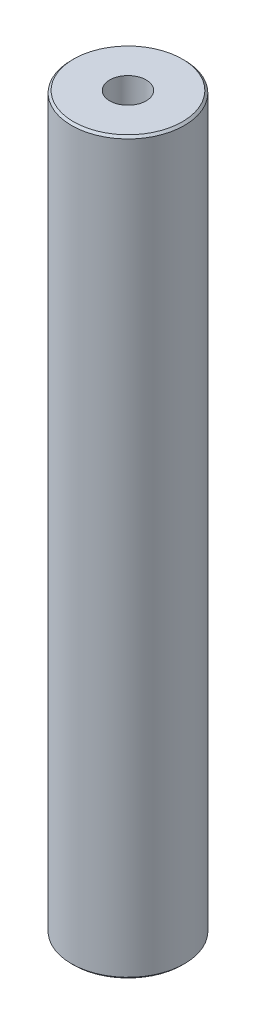
ISO-10303-21;
HEADER;
FILE_DESCRIPTION(('STEP AP214'),'2;1');
FILE_NAME('part.step','',(''),(''),'','','');
FILE_SCHEMA(('AUTOMOTIVE_DESIGN { 1 0 10303 214 1 1 1 1 }'));
ENDSEC;
DATA;
#1=APPLICATION_CONTEXT('core data for automotive mechanical design processes');
#2=APPLICATION_PROTOCOL_DEFINITION('international standard','automotive_design',2000,#1);
#3=PRODUCT_CONTEXT('',#1,'mechanical');
#4=PRODUCT('Part','Part','',(#3));
#5=PRODUCT_RELATED_PRODUCT_CATEGORY('part','',(#4));
#6=PRODUCT_DEFINITION_FORMATION('','',#4);
#7=PRODUCT_DEFINITION_CONTEXT('part definition',#1,'design');
#8=PRODUCT_DEFINITION('design','',#6,#7);
#9=PRODUCT_DEFINITION_SHAPE('','',#8);
#10=(LENGTH_UNIT() NAMED_UNIT(*) SI_UNIT(.MILLI.,.METRE.));
#11=(NAMED_UNIT(*) PLANE_ANGLE_UNIT() SI_UNIT($,.RADIAN.));
#12=(NAMED_UNIT(*) SI_UNIT($,.STERADIAN.) SOLID_ANGLE_UNIT());
#13=UNCERTAINTY_MEASURE_WITH_UNIT(LENGTH_MEASURE(1.E-05),#10,'distance_accuracy_value','');
#14=(GEOMETRIC_REPRESENTATION_CONTEXT(3) GLOBAL_UNCERTAINTY_ASSIGNED_CONTEXT((#13)) GLOBAL_UNIT_ASSIGNED_CONTEXT((#10,
#11,#12)) REPRESENTATION_CONTEXT('',''));
#15=CARTESIAN_POINT('',(0.,0.,0.));
#16=DIRECTION('',(0.,0.,1.));
#17=DIRECTION('',(1.,0.,0.));
#18=AXIS2_PLACEMENT_3D('',#15,#16,#17);
#19=CARTESIAN_POINT('',(0.,484.642296781617,0.));
#20=DIRECTION('',(0.,-1.,0.));
#21=DIRECTION('',(0.,0.,-1.));
#22=AXIS2_PLACEMENT_3D('',#19,#20,#21);
#23=CYLINDRICAL_SURFACE('',#22,37.5);
#24=CARTESIAN_POINT('',(0.,483.232724346313,0.));
#25=DIRECTION('',(0.,1.,0.));
#26=DIRECTION('',(0.,0.,1.));
#27=AXIS2_PLACEMENT_3D('',#24,#25,#26);
#28=CIRCLE('',#27,37.5);
#29=CARTESIAN_POINT('',(0.,483.232724346313,37.5));
#30=VERTEX_POINT('',#29);
#31=EDGE_CURVE('E50',#30,#30,#28,.F.);
#32=ORIENTED_EDGE('',*,*,#31,.T.);
#33=EDGE_LOOP('',(#32));
#34=FACE_BOUND('',#33,.T.);
#35=CARTESIAN_POINT('',(0.,1.4095724353041,0.));
#36=DIRECTION('',(0.,1.,0.));
#37=DIRECTION('',(0.,0.,1.));
#38=AXIS2_PLACEMENT_3D('',#35,#36,#37);
#39=CIRCLE('',#38,37.5);
#40=CARTESIAN_POINT('',(0.,1.4095724353041,37.5));
#41=VERTEX_POINT('',#40);
#42=EDGE_CURVE('E51',#41,#41,#39,.T.);
#43=ORIENTED_EDGE('',*,*,#42,.T.);
#44=EDGE_LOOP('',(#43));
#45=FACE_BOUND('',#44,.T.);
#46=ADVANCED_FACE('F39',(#34,#45),#23,.T.);
#47=CARTESIAN_POINT('',(0.,484.642296781617,0.));
#48=DIRECTION('',(0.,1.,0.));
#49=DIRECTION('',(0.,0.,1.));
#50=AXIS2_PLACEMENT_3D('',#47,#48,#49);
#51=PLANE('',#50);
#52=CARTESIAN_POINT('',(0.,484.642296781617,0.));
#53=DIRECTION('',(0.,1.,0.));
#54=DIRECTION('',(0.,0.,1.));
#55=AXIS2_PLACEMENT_3D('',#52,#53,#54);
#56=CIRCLE('',#55,36.090427564696);
#57=CARTESIAN_POINT('',(0.,484.642296781617,36.090427564696));
#58=VERTEX_POINT('',#57);
#59=EDGE_CURVE('E54',#58,#58,#56,.T.);
#60=ORIENTED_EDGE('',*,*,#59,.T.);
#61=EDGE_LOOP('',(#60));
#62=FACE_BOUND('',#61,.T.);
#63=CARTESIAN_POINT('',(0.,484.642296781617,0.));
#64=DIRECTION('',(0.,1.,0.));
#65=DIRECTION('',(0.,0.,1.));
#66=AXIS2_PLACEMENT_3D('',#63,#64,#65);
#67=CIRCLE('',#66,12.0826649952808);
#68=CARTESIAN_POINT('',(0.,484.642296781617,12.0826649952808));
#69=VERTEX_POINT('',#68);
#70=EDGE_CURVE('E58',#69,#69,#67,.T.);
#71=ORIENTED_EDGE('',*,*,#70,.F.);
#72=EDGE_LOOP('',(#71));
#73=FACE_BOUND('',#72,.T.);
#74=ADVANCED_FACE('F69',(#62,#73),#51,.T.);
#75=CARTESIAN_POINT('',(0.,0.,0.));
#76=DIRECTION('',(0.,1.,0.));
#77=DIRECTION('',(0.,0.,1.));
#78=AXIS2_PLACEMENT_3D('',#75,#76,#77);
#79=PLANE('',#78);
#80=CARTESIAN_POINT('',(0.,0.,0.));
#81=DIRECTION('',(0.,1.,0.));
#82=DIRECTION('',(0.,0.,1.));
#83=AXIS2_PLACEMENT_3D('',#80,#81,#82);
#84=CIRCLE('',#83,36.0904275646959);
#85=CARTESIAN_POINT('',(0.,0.,36.0904275646959));
#86=VERTEX_POINT('',#85);
#87=EDGE_CURVE('E10',#86,#86,#84,.F.);
#88=ORIENTED_EDGE('',*,*,#87,.T.);
#89=EDGE_LOOP('',(#88));
#90=FACE_BOUND('',#89,.T.);
#91=CARTESIAN_POINT('',(0.,0.,0.));
#92=DIRECTION('',(0.,1.,0.));
#93=DIRECTION('',(0.,0.,1.));
#94=AXIS2_PLACEMENT_3D('',#91,#92,#93);
#95=CIRCLE('',#94,12.0826649952808);
#96=CARTESIAN_POINT('',(0.,0.,12.0826649952808));
#97=VERTEX_POINT('',#96);
#98=EDGE_CURVE('E63',#97,#97,#95,.T.);
#99=ORIENTED_EDGE('',*,*,#98,.T.);
#100=EDGE_LOOP('',(#99));
#101=FACE_BOUND('',#100,.T.);
#102=ADVANCED_FACE('F75',(#90,#101),#79,.F.);
#103=CARTESIAN_POINT('',(0.,484.642296781617,0.));
#104=DIRECTION('',(0.,-1.,0.));
#105=DIRECTION('',(0.,0.,-1.));
#106=AXIS2_PLACEMENT_3D('',#103,#104,#105);
#107=CYLINDRICAL_SURFACE('',#106,12.0826649952808);
#108=ORIENTED_EDGE('',*,*,#70,.T.);
#109=EDGE_LOOP('',(#108));
#110=FACE_BOUND('',#109,.T.);
#111=ORIENTED_EDGE('',*,*,#98,.F.);
#112=EDGE_LOOP('',(#111));
#113=FACE_BOUND('',#112,.T.);
#114=ADVANCED_FACE('F70',(#110,#113),#107,.F.);
#115=CARTESIAN_POINT('',(0.,484.642296781617,0.));
#116=DIRECTION('',(0.,-1.,0.));
#117=DIRECTION('',(0.,0.,-1.));
#118=AXIS2_PLACEMENT_3D('',#115,#116,#117);
#119=CONICAL_SURFACE('',#118,36.090427564696,0.785398163397458);
#120=ORIENTED_EDGE('',*,*,#31,.F.);
#121=EDGE_LOOP('',(#120));
#122=FACE_BOUND('',#121,.T.);
#123=ORIENTED_EDGE('',*,*,#59,.F.);
#124=EDGE_LOOP('',(#123));
#125=FACE_BOUND('',#124,.T.);
#126=ADVANCED_FACE('F81',(#122,#125),#119,.T.);
#127=CARTESIAN_POINT('',(0.,1.4095724353041,0.));
#128=DIRECTION('',(0.,1.,0.));
#129=DIRECTION('',(0.,0.,1.));
#130=AXIS2_PLACEMENT_3D('',#127,#128,#129);
#131=CONICAL_SURFACE('',#130,37.5,0.785398163397458);
#132=ORIENTED_EDGE('',*,*,#87,.F.);
#133=EDGE_LOOP('',(#132));
#134=FACE_BOUND('',#133,.T.);
#135=ORIENTED_EDGE('',*,*,#42,.F.);
#136=EDGE_LOOP('',(#135));
#137=FACE_BOUND('',#136,.T.);
#138=ADVANCED_FACE('F45',(#134,#137),#131,.T.);
#139=CLOSED_SHELL('',(#46,#74,#102,#114,#126,#138));
#140=MANIFOLD_SOLID_BREP('B2',#139);
#141=ADVANCED_BREP_SHAPE_REPRESENTATION('',(#18,#140),#14);
#142=SHAPE_DEFINITION_REPRESENTATION(#9,#141);
ENDSEC;
END-ISO-10303-21;
